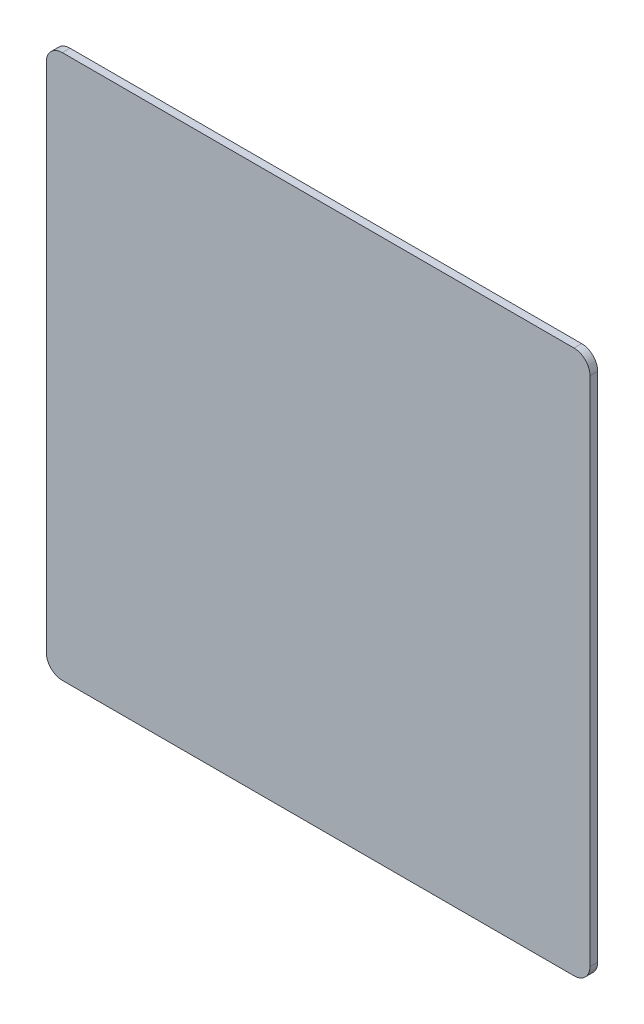
ISO-10303-21;
HEADER;
FILE_DESCRIPTION(('STEP AP214'),'2;1');
FILE_NAME('part.step','',(''),(''),'','','');
FILE_SCHEMA(('AUTOMOTIVE_DESIGN { 1 0 10303 214 1 1 1 1 }'));
ENDSEC;
DATA;
#1=APPLICATION_CONTEXT('core data for automotive mechanical design processes');
#2=APPLICATION_PROTOCOL_DEFINITION('international standard','automotive_design',2000,#1);
#3=PRODUCT_CONTEXT('',#1,'mechanical');
#4=PRODUCT('Part','Part','',(#3));
#5=PRODUCT_RELATED_PRODUCT_CATEGORY('part','',(#4));
#6=PRODUCT_DEFINITION_FORMATION('','',#4);
#7=PRODUCT_DEFINITION_CONTEXT('part definition',#1,'design');
#8=PRODUCT_DEFINITION('design','',#6,#7);
#9=PRODUCT_DEFINITION_SHAPE('','',#8);
#10=(LENGTH_UNIT() NAMED_UNIT(*) SI_UNIT(.MILLI.,.METRE.));
#11=(NAMED_UNIT(*) PLANE_ANGLE_UNIT() SI_UNIT($,.RADIAN.));
#12=(NAMED_UNIT(*) SI_UNIT($,.STERADIAN.) SOLID_ANGLE_UNIT());
#13=UNCERTAINTY_MEASURE_WITH_UNIT(LENGTH_MEASURE(1.E-05),#10,'distance_accuracy_value','');
#14=(GEOMETRIC_REPRESENTATION_CONTEXT(3) GLOBAL_UNCERTAINTY_ASSIGNED_CONTEXT((#13)) GLOBAL_UNIT_ASSIGNED_CONTEXT((#10,
#11,#12)) REPRESENTATION_CONTEXT('',''));
#15=CARTESIAN_POINT('',(0.,0.,0.));
#16=DIRECTION('',(0.,0.,1.));
#17=DIRECTION('',(1.,0.,0.));
#18=AXIS2_PLACEMENT_3D('',#15,#16,#17);
#19=CARTESIAN_POINT('',(8.,0.25,0.));
#20=DIRECTION('',(0.,0.,1.));
#21=DIRECTION('',(1.,0.,0.));
#22=AXIS2_PLACEMENT_3D('',#19,#20,#21);
#23=CYLINDRICAL_SURFACE('',#22,0.25);
#24=CARTESIAN_POINT('',(8.,0.25,0.12));
#25=DIRECTION('',(0.,0.,1.));
#26=DIRECTION('',(1.,0.,0.));
#27=AXIS2_PLACEMENT_3D('',#24,#25,#26);
#28=CIRCLE('',#27,0.25);
#29=CARTESIAN_POINT('',(8.,0.,0.12));
#30=VERTEX_POINT('',#29);
#31=CARTESIAN_POINT('',(8.25,0.25,0.12));
#32=VERTEX_POINT('',#31);
#33=EDGE_CURVE('E142',#30,#32,#28,.T.);
#34=ORIENTED_EDGE('',*,*,#33,.F.);
#35=DIRECTION('',(0.,0.,1.));
#36=VECTOR('',#35,1.);
#37=CARTESIAN_POINT('',(8.,0.,0.));
#38=LINE('',#37,#36);
#39=CARTESIAN_POINT('',(8.,0.,0.));
#40=VERTEX_POINT('',#39);
#41=EDGE_CURVE('E11',#40,#30,#38,.T.);
#42=ORIENTED_EDGE('',*,*,#41,.F.);
#43=CARTESIAN_POINT('',(8.,0.25,0.));
#44=DIRECTION('',(0.,0.,1.));
#45=DIRECTION('',(1.,0.,0.));
#46=AXIS2_PLACEMENT_3D('',#43,#44,#45);
#47=CIRCLE('',#46,0.25);
#48=CARTESIAN_POINT('',(8.25,0.25,0.));
#49=VERTEX_POINT('',#48);
#50=EDGE_CURVE('E170',#40,#49,#47,.T.);
#51=ORIENTED_EDGE('',*,*,#50,.T.);
#52=DIRECTION('',(0.,0.,1.));
#53=VECTOR('',#52,1.);
#54=CARTESIAN_POINT('',(8.25,0.25,0.));
#55=LINE('',#54,#53);
#56=EDGE_CURVE('E42',#49,#32,#55,.T.);
#57=ORIENTED_EDGE('',*,*,#56,.T.);
#58=EDGE_LOOP('',(#34,#42,#51,#57));
#59=FACE_BOUND('',#58,.T.);
#60=ADVANCED_FACE('F39',(#59),#23,.T.);
#61=CARTESIAN_POINT('',(0.,0.,0.));
#62=DIRECTION('',(0.,-1.,0.));
#63=DIRECTION('',(0.,0.,-1.));
#64=AXIS2_PLACEMENT_3D('',#61,#62,#63);
#65=PLANE('',#64);
#66=DIRECTION('',(1.,0.,0.));
#67=VECTOR('',#66,1.);
#68=CARTESIAN_POINT('',(0.,0.,0.12));
#69=LINE('',#68,#67);
#70=CARTESIAN_POINT('',(0.,0.,0.12));
#71=VERTEX_POINT('',#70);
#72=EDGE_CURVE('E167',#71,#30,#69,.T.);
#73=ORIENTED_EDGE('',*,*,#72,.F.);
#74=DIRECTION('',(0.,0.,1.));
#75=VECTOR('',#74,1.);
#76=CARTESIAN_POINT('',(0.,0.,0.));
#77=LINE('',#76,#75);
#78=CARTESIAN_POINT('',(0.,0.,0.));
#79=VERTEX_POINT('',#78);
#80=EDGE_CURVE('E49',#79,#71,#77,.T.);
#81=ORIENTED_EDGE('',*,*,#80,.F.);
#82=DIRECTION('',(1.,0.,0.));
#83=VECTOR('',#82,1.);
#84=CARTESIAN_POINT('',(0.,0.,0.));
#85=LINE('',#84,#83);
#86=EDGE_CURVE('E128',#79,#40,#85,.T.);
#87=ORIENTED_EDGE('',*,*,#86,.T.);
#88=ORIENTED_EDGE('',*,*,#41,.T.);
#89=EDGE_LOOP('',(#73,#81,#87,#88));
#90=FACE_BOUND('',#89,.T.);
#91=ADVANCED_FACE('F188',(#90),#65,.T.);
#92=CARTESIAN_POINT('',(0.,0.249999999999999,0.));
#93=DIRECTION('',(0.,0.,1.));
#94=DIRECTION('',(1.,0.,0.));
#95=AXIS2_PLACEMENT_3D('',#92,#93,#94);
#96=CYLINDRICAL_SURFACE('',#95,0.249999999999999);
#97=CARTESIAN_POINT('',(0.,0.249999999999999,0.12));
#98=DIRECTION('',(0.,0.,1.));
#99=DIRECTION('',(1.,0.,0.));
#100=AXIS2_PLACEMENT_3D('',#97,#98,#99);
#101=CIRCLE('',#100,0.249999999999999);
#102=CARTESIAN_POINT('',(-0.249999999999999,0.249999999999999,0.12));
#103=VERTEX_POINT('',#102);
#104=EDGE_CURVE('E114',#103,#71,#101,.T.);
#105=ORIENTED_EDGE('',*,*,#104,.F.);
#106=DIRECTION('',(0.,0.,1.));
#107=VECTOR('',#106,1.);
#108=CARTESIAN_POINT('',(-0.249999999999999,0.249999999999999,0.));
#109=LINE('',#108,#107);
#110=CARTESIAN_POINT('',(-0.249999999999999,0.249999999999999,0.));
#111=VERTEX_POINT('',#110);
#112=EDGE_CURVE('E109',#111,#103,#109,.T.);
#113=ORIENTED_EDGE('',*,*,#112,.F.);
#114=CARTESIAN_POINT('',(0.,0.249999999999999,0.));
#115=DIRECTION('',(0.,0.,1.));
#116=DIRECTION('',(1.,0.,0.));
#117=AXIS2_PLACEMENT_3D('',#114,#115,#116);
#118=CIRCLE('',#117,0.249999999999999);
#119=EDGE_CURVE('E112',#111,#79,#118,.T.);
#120=ORIENTED_EDGE('',*,*,#119,.T.);
#121=ORIENTED_EDGE('',*,*,#80,.T.);
#122=EDGE_LOOP('',(#105,#113,#120,#121));
#123=FACE_BOUND('',#122,.T.);
#124=ADVANCED_FACE('F111',(#123),#96,.T.);
#125=CARTESIAN_POINT('',(-0.250000000000001,8.25,0.));
#126=DIRECTION('',(-1.,0.,0.));
#127=DIRECTION('',(0.,-1.,0.));
#128=AXIS2_PLACEMENT_3D('',#125,#126,#127);
#129=PLANE('',#128);
#130=DIRECTION('',(0.,-1.,0.));
#131=VECTOR('',#130,1.);
#132=CARTESIAN_POINT('',(-0.250000000000001,8.25,0.12));
#133=LINE('',#132,#131);
#134=CARTESIAN_POINT('',(-0.250000000000001,8.25,0.12));
#135=VERTEX_POINT('',#134);
#136=EDGE_CURVE('E162',#135,#103,#133,.T.);
#137=ORIENTED_EDGE('',*,*,#136,.F.);
#138=DIRECTION('',(0.,0.,1.));
#139=VECTOR('',#138,1.);
#140=CARTESIAN_POINT('',(-0.250000000000001,8.25,0.));
#141=LINE('',#140,#139);
#142=CARTESIAN_POINT('',(-0.250000000000001,8.25,0.));
#143=VERTEX_POINT('',#142);
#144=EDGE_CURVE('E120',#143,#135,#141,.T.);
#145=ORIENTED_EDGE('',*,*,#144,.F.);
#146=DIRECTION('',(0.,-1.,0.));
#147=VECTOR('',#146,1.);
#148=CARTESIAN_POINT('',(-0.250000000000001,8.25,0.));
#149=LINE('',#148,#147);
#150=EDGE_CURVE('E126',#143,#111,#149,.T.);
#151=ORIENTED_EDGE('',*,*,#150,.T.);
#152=ORIENTED_EDGE('',*,*,#112,.T.);
#153=EDGE_LOOP('',(#137,#145,#151,#152));
#154=FACE_BOUND('',#153,.T.);
#155=ADVANCED_FACE('F131',(#154),#129,.T.);
#156=CARTESIAN_POINT('',(0.,8.25,0.));
#157=DIRECTION('',(0.,0.,1.));
#158=DIRECTION('',(1.,0.,0.));
#159=AXIS2_PLACEMENT_3D('',#156,#157,#158);
#160=CYLINDRICAL_SURFACE('',#159,0.250000000000001);
#161=CARTESIAN_POINT('',(0.,8.25,0.12));
#162=DIRECTION('',(0.,0.,1.));
#163=DIRECTION('',(1.,0.,0.));
#164=AXIS2_PLACEMENT_3D('',#161,#162,#163);
#165=CIRCLE('',#164,0.250000000000001);
#166=CARTESIAN_POINT('',(0.,8.5,0.12));
#167=VERTEX_POINT('',#166);
#168=EDGE_CURVE('E158',#167,#135,#165,.T.);
#169=ORIENTED_EDGE('',*,*,#168,.F.);
#170=DIRECTION('',(0.,0.,1.));
#171=VECTOR('',#170,1.);
#172=CARTESIAN_POINT('',(0.,8.5,0.));
#173=LINE('',#172,#171);
#174=CARTESIAN_POINT('',(0.,8.5,0.));
#175=VERTEX_POINT('',#174);
#176=EDGE_CURVE('E176',#175,#167,#173,.T.);
#177=ORIENTED_EDGE('',*,*,#176,.F.);
#178=CARTESIAN_POINT('',(0.,8.25,0.));
#179=DIRECTION('',(0.,0.,1.));
#180=DIRECTION('',(1.,0.,0.));
#181=AXIS2_PLACEMENT_3D('',#178,#179,#180);
#182=CIRCLE('',#181,0.250000000000001);
#183=EDGE_CURVE('E133',#175,#143,#182,.T.);
#184=ORIENTED_EDGE('',*,*,#183,.T.);
#185=ORIENTED_EDGE('',*,*,#144,.T.);
#186=EDGE_LOOP('',(#169,#177,#184,#185));
#187=FACE_BOUND('',#186,.T.);
#188=ADVANCED_FACE('F201',(#187),#160,.T.);
#189=CARTESIAN_POINT('',(8.,8.5,0.));
#190=DIRECTION('',(0.,1.,0.));
#191=DIRECTION('',(0.,0.,1.));
#192=AXIS2_PLACEMENT_3D('',#189,#190,#191);
#193=PLANE('',#192);
#194=DIRECTION('',(-1.,0.,0.));
#195=VECTOR('',#194,1.);
#196=CARTESIAN_POINT('',(8.,8.5,0.12));
#197=LINE('',#196,#195);
#198=CARTESIAN_POINT('',(8.,8.5,0.12));
#199=VERTEX_POINT('',#198);
#200=EDGE_CURVE('E154',#199,#167,#197,.T.);
#201=ORIENTED_EDGE('',*,*,#200,.F.);
#202=DIRECTION('',(0.,0.,1.));
#203=VECTOR('',#202,1.);
#204=CARTESIAN_POINT('',(8.,8.5,0.));
#205=LINE('',#204,#203);
#206=CARTESIAN_POINT('',(8.,8.5,0.));
#207=VERTEX_POINT('',#206);
#208=EDGE_CURVE('E179',#207,#199,#205,.T.);
#209=ORIENTED_EDGE('',*,*,#208,.F.);
#210=DIRECTION('',(-1.,0.,0.));
#211=VECTOR('',#210,1.);
#212=CARTESIAN_POINT('',(8.,8.5,0.));
#213=LINE('',#212,#211);
#214=EDGE_CURVE('E136',#207,#175,#213,.T.);
#215=ORIENTED_EDGE('',*,*,#214,.T.);
#216=ORIENTED_EDGE('',*,*,#176,.T.);
#217=EDGE_LOOP('',(#201,#209,#215,#216));
#218=FACE_BOUND('',#217,.T.);
#219=ADVANCED_FACE('F204',(#218),#193,.T.);
#220=CARTESIAN_POINT('',(8.,8.25,0.));
#221=DIRECTION('',(0.,0.,1.));
#222=DIRECTION('',(1.,0.,0.));
#223=AXIS2_PLACEMENT_3D('',#220,#221,#222);
#224=CYLINDRICAL_SURFACE('',#223,0.25);
#225=CARTESIAN_POINT('',(8.,8.25,0.12));
#226=DIRECTION('',(0.,0.,1.));
#227=DIRECTION('',(1.,0.,0.));
#228=AXIS2_PLACEMENT_3D('',#225,#226,#227);
#229=CIRCLE('',#228,0.25);
#230=CARTESIAN_POINT('',(8.25,8.25,0.12));
#231=VERTEX_POINT('',#230);
#232=EDGE_CURVE('E150',#231,#199,#229,.T.);
#233=ORIENTED_EDGE('',*,*,#232,.F.);
#234=DIRECTION('',(0.,0.,1.));
#235=VECTOR('',#234,1.);
#236=CARTESIAN_POINT('',(8.25,8.25,0.));
#237=LINE('',#236,#235);
#238=CARTESIAN_POINT('',(8.25,8.25,0.));
#239=VERTEX_POINT('',#238);
#240=EDGE_CURVE('E181',#239,#231,#237,.T.);
#241=ORIENTED_EDGE('',*,*,#240,.F.);
#242=CARTESIAN_POINT('',(8.,8.25,0.));
#243=DIRECTION('',(0.,0.,1.));
#244=DIRECTION('',(1.,0.,0.));
#245=AXIS2_PLACEMENT_3D('',#242,#243,#244);
#246=CIRCLE('',#245,0.25);
#247=EDGE_CURVE('E279',#239,#207,#246,.T.);
#248=ORIENTED_EDGE('',*,*,#247,.T.);
#249=ORIENTED_EDGE('',*,*,#208,.T.);
#250=EDGE_LOOP('',(#233,#241,#248,#249));
#251=FACE_BOUND('',#250,.T.);
#252=ADVANCED_FACE('F208',(#251),#224,.T.);
#253=CARTESIAN_POINT('',(8.25,0.25,0.));
#254=DIRECTION('',(1.,0.,0.));
#255=DIRECTION('',(0.,0.,-1.));
#256=AXIS2_PLACEMENT_3D('',#253,#254,#255);
#257=PLANE('',#256);
#258=DIRECTION('',(0.,1.,0.));
#259=VECTOR('',#258,1.);
#260=CARTESIAN_POINT('',(8.25,0.25,0.12));
#261=LINE('',#260,#259);
#262=EDGE_CURVE('E146',#32,#231,#261,.T.);
#263=ORIENTED_EDGE('',*,*,#262,.F.);
#264=ORIENTED_EDGE('',*,*,#56,.F.);
#265=DIRECTION('',(0.,1.,0.));
#266=VECTOR('',#265,1.);
#267=CARTESIAN_POINT('',(8.25,0.25,0.));
#268=LINE('',#267,#266);
#269=EDGE_CURVE('E282',#49,#239,#268,.T.);
#270=ORIENTED_EDGE('',*,*,#269,.T.);
#271=ORIENTED_EDGE('',*,*,#240,.T.);
#272=EDGE_LOOP('',(#263,#264,#270,#271));
#273=FACE_BOUND('',#272,.T.);
#274=ADVANCED_FACE('F185',(#273),#257,.T.);
#275=CARTESIAN_POINT('',(8.,0.25,0.));
#276=DIRECTION('',(0.,0.,1.));
#277=DIRECTION('',(1.,0.,0.));
#278=AXIS2_PLACEMENT_3D('',#275,#276,#277);
#279=PLANE('',#278);
#280=ORIENTED_EDGE('',*,*,#50,.F.);
#281=ORIENTED_EDGE('',*,*,#86,.F.);
#282=ORIENTED_EDGE('',*,*,#119,.F.);
#283=ORIENTED_EDGE('',*,*,#150,.F.);
#284=ORIENTED_EDGE('',*,*,#183,.F.);
#285=ORIENTED_EDGE('',*,*,#214,.F.);
#286=ORIENTED_EDGE('',*,*,#247,.F.);
#287=ORIENTED_EDGE('',*,*,#269,.F.);
#288=EDGE_LOOP('',(#280,#281,#282,#283,#284,#285,#286,#287));
#289=FACE_BOUND('',#288,.T.);
#290=ADVANCED_FACE('F124',(#289),#279,.F.);
#291=CARTESIAN_POINT('',(8.,0.25,0.12));
#292=DIRECTION('',(0.,0.,1.));
#293=DIRECTION('',(1.,0.,0.));
#294=AXIS2_PLACEMENT_3D('',#291,#292,#293);
#295=PLANE('',#294);
#296=ORIENTED_EDGE('',*,*,#33,.T.);
#297=ORIENTED_EDGE('',*,*,#262,.T.);
#298=ORIENTED_EDGE('',*,*,#232,.T.);
#299=ORIENTED_EDGE('',*,*,#200,.T.);
#300=ORIENTED_EDGE('',*,*,#168,.T.);
#301=ORIENTED_EDGE('',*,*,#136,.T.);
#302=ORIENTED_EDGE('',*,*,#104,.T.);
#303=ORIENTED_EDGE('',*,*,#72,.T.);
#304=EDGE_LOOP('',(#296,#297,#298,#299,#300,#301,#302,#303));
#305=FACE_BOUND('',#304,.T.);
#306=ADVANCED_FACE('F187',(#305),#295,.T.);
#307=CLOSED_SHELL('',(#60,#91,#124,#155,#188,#219,#252,#274,#290,#306));
#308=MANIFOLD_SOLID_BREP('B2',#307);
#309=ADVANCED_BREP_SHAPE_REPRESENTATION('',(#18,#308),#14);
#310=SHAPE_DEFINITION_REPRESENTATION(#9,#309);
ENDSEC;
END-ISO-10303-21;
